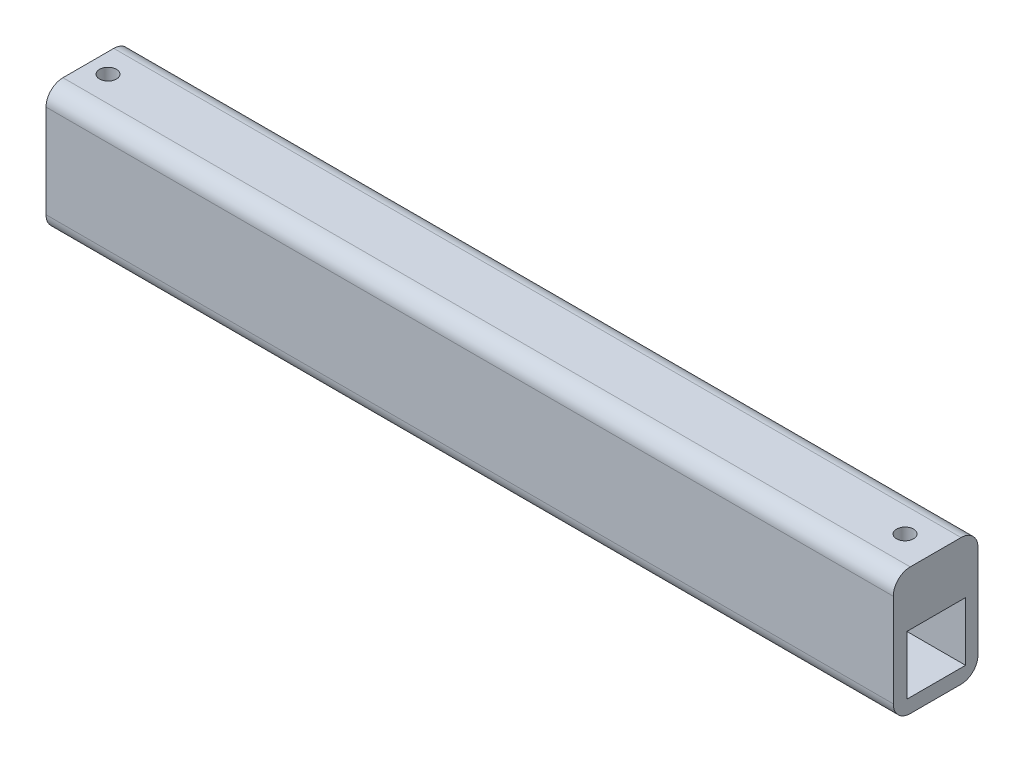
ISO-10303-21;
HEADER;
FILE_DESCRIPTION(('STEP AP214'),'2;1');
FILE_NAME('part.step','',(''),(''),'','','');
FILE_SCHEMA(('AUTOMOTIVE_DESIGN { 1 0 10303 214 1 1 1 1 }'));
ENDSEC;
DATA;
#1=APPLICATION_CONTEXT('core data for automotive mechanical design processes');
#2=APPLICATION_PROTOCOL_DEFINITION('international standard','automotive_design',2000,#1);
#3=PRODUCT_CONTEXT('',#1,'mechanical');
#4=PRODUCT('Part','Part','',(#3));
#5=PRODUCT_RELATED_PRODUCT_CATEGORY('part','',(#4));
#6=PRODUCT_DEFINITION_FORMATION('','',#4);
#7=PRODUCT_DEFINITION_CONTEXT('part definition',#1,'design');
#8=PRODUCT_DEFINITION('design','',#6,#7);
#9=PRODUCT_DEFINITION_SHAPE('','',#8);
#10=(LENGTH_UNIT() NAMED_UNIT(*) SI_UNIT(.MILLI.,.METRE.));
#11=(NAMED_UNIT(*) PLANE_ANGLE_UNIT() SI_UNIT($,.RADIAN.));
#12=(NAMED_UNIT(*) SI_UNIT($,.STERADIAN.) SOLID_ANGLE_UNIT());
#13=UNCERTAINTY_MEASURE_WITH_UNIT(LENGTH_MEASURE(1.E-05),#10,'distance_accuracy_value','');
#14=(GEOMETRIC_REPRESENTATION_CONTEXT(3) GLOBAL_UNCERTAINTY_ASSIGNED_CONTEXT((#13)) GLOBAL_UNIT_ASSIGNED_CONTEXT((#10,
#11,#12)) REPRESENTATION_CONTEXT('',''));
#15=CARTESIAN_POINT('',(0.,0.,0.));
#16=DIRECTION('',(0.,0.,1.));
#17=DIRECTION('',(1.,0.,0.));
#18=AXIS2_PLACEMENT_3D('',#15,#16,#17);
#19=CARTESIAN_POINT('',(-89.2448512585812,8.83295194508008,20.));
#20=DIRECTION('',(1.,0.,0.));
#21=DIRECTION('',(0.,1.,0.));
#22=AXIS2_PLACEMENT_3D('',#19,#20,#21);
#23=PLANE('',#22);
#24=DIRECTION('',(0.,0.,1.));
#25=VECTOR('',#24,1.);
#26=CARTESIAN_POINT('',(-89.2448512585812,-17.8165488906242,2.9396604398922));
#27=LINE('',#26,#25);
#28=CARTESIAN_POINT('',(-89.2448512585812,-17.8165488906242,2.9396604398922));
#29=VERTEX_POINT('',#28);
#30=CARTESIAN_POINT('',(-89.2448512585812,-17.8165488906242,16.8168795752765));
#31=VERTEX_POINT('',#30);
#32=EDGE_CURVE('E153',#29,#31,#27,.T.);
#33=ORIENTED_EDGE('',*,*,#32,.F.);
#34=DIRECTION('',(0.,-1.,0.));
#35=VECTOR('',#34,1.);
#36=CARTESIAN_POINT('',(-89.2448512585812,-3.96976225334377,2.9396604398922));
#37=LINE('',#36,#35);
#38=CARTESIAN_POINT('',(-89.2448512585812,-3.96976225334377,2.9396604398922));
#39=VERTEX_POINT('',#38);
#40=EDGE_CURVE('E50',#39,#29,#37,.T.);
#41=ORIENTED_EDGE('',*,*,#40,.F.);
#42=DIRECTION('',(0.,0.,-1.));
#43=VECTOR('',#42,1.);
#44=CARTESIAN_POINT('',(-89.2448512585812,-3.96976225334377,2.9396604398922));
#45=LINE('',#44,#43);
#46=CARTESIAN_POINT('',(-89.2448512585812,-3.96976225334377,16.8168795752765));
#47=VERTEX_POINT('',#46);
#48=EDGE_CURVE('E141',#47,#39,#45,.T.);
#49=ORIENTED_EDGE('',*,*,#48,.F.);
#50=DIRECTION('',(0.,1.,0.));
#51=VECTOR('',#50,1.);
#52=CARTESIAN_POINT('',(-89.2448512585812,-3.96976225334377,16.8168795752765));
#53=LINE('',#52,#51);
#54=EDGE_CURVE('E144',#31,#47,#53,.T.);
#55=ORIENTED_EDGE('',*,*,#54,.F.);
#56=EDGE_LOOP('',(#33,#41,#49,#55));
#57=FACE_BOUND('',#56,.T.);
#58=DIRECTION('',(0.,-1.,0.));
#59=VECTOR('',#58,1.);
#60=CARTESIAN_POINT('',(-89.2448512585812,8.83295194508008,0.));
#61=LINE('',#60,#59);
#62=CARTESIAN_POINT('',(-89.2448512585812,4.83295194508008,0.));
#63=VERTEX_POINT('',#62);
#64=CARTESIAN_POINT('',(-89.2448512585812,-17.1670480549199,0.));
#65=VERTEX_POINT('',#64);
#66=EDGE_CURVE('E160',#63,#65,#61,.T.);
#67=ORIENTED_EDGE('',*,*,#66,.T.);
#68=CARTESIAN_POINT('',(-89.2448512585812,-17.1670480549199,4.));
#69=DIRECTION('',(1.,0.,0.));
#70=DIRECTION('',(0.,1.,0.));
#71=AXIS2_PLACEMENT_3D('',#68,#69,#70);
#72=CIRCLE('',#71,4.);
#73=CARTESIAN_POINT('',(-89.2448512585812,-21.1670480549199,4.));
#74=VERTEX_POINT('',#73);
#75=EDGE_CURVE('E210',#65,#74,#72,.F.);
#76=ORIENTED_EDGE('',*,*,#75,.T.);
#77=DIRECTION('',(0.,0.,-1.));
#78=VECTOR('',#77,1.);
#79=CARTESIAN_POINT('',(-89.2448512585812,-21.1670480549199,20.));
#80=LINE('',#79,#78);
#81=CARTESIAN_POINT('',(-89.2448512585812,-21.1670480549199,16.));
#82=VERTEX_POINT('',#81);
#83=EDGE_CURVE('E184',#82,#74,#80,.T.);
#84=ORIENTED_EDGE('',*,*,#83,.F.);
#85=CARTESIAN_POINT('',(-89.2448512585812,-17.1670480549199,16.));
#86=DIRECTION('',(1.,0.,0.));
#87=DIRECTION('',(0.,1.,0.));
#88=AXIS2_PLACEMENT_3D('',#85,#86,#87);
#89=CIRCLE('',#88,4.);
#90=CARTESIAN_POINT('',(-89.2448512585812,-17.1670480549199,20.));
#91=VERTEX_POINT('',#90);
#92=EDGE_CURVE('E208',#82,#91,#89,.F.);
#93=ORIENTED_EDGE('',*,*,#92,.T.);
#94=DIRECTION('',(0.,-1.,0.));
#95=VECTOR('',#94,1.);
#96=CARTESIAN_POINT('',(-89.2448512585812,8.83295194508008,20.));
#97=LINE('',#96,#95);
#98=CARTESIAN_POINT('',(-89.2448512585812,4.83295194508008,20.));
#99=VERTEX_POINT('',#98);
#100=EDGE_CURVE('E164',#99,#91,#97,.T.);
#101=ORIENTED_EDGE('',*,*,#100,.F.);
#102=CARTESIAN_POINT('',(-89.2448512585812,4.83295194508008,16.));
#103=DIRECTION('',(1.,0.,0.));
#104=DIRECTION('',(0.,1.,0.));
#105=AXIS2_PLACEMENT_3D('',#102,#103,#104);
#106=CIRCLE('',#105,4.);
#107=CARTESIAN_POINT('',(-89.2448512585812,8.83295194508008,16.));
#108=VERTEX_POINT('',#107);
#109=EDGE_CURVE('E206',#99,#108,#106,.F.);
#110=ORIENTED_EDGE('',*,*,#109,.T.);
#111=DIRECTION('',(0.,0.,-1.));
#112=VECTOR('',#111,1.);
#113=CARTESIAN_POINT('',(-89.2448512585812,8.83295194508008,20.));
#114=LINE('',#113,#112);
#115=CARTESIAN_POINT('',(-89.2448512585812,8.83295194508008,4.));
#116=VERTEX_POINT('',#115);
#117=EDGE_CURVE('E171',#108,#116,#114,.T.);
#118=ORIENTED_EDGE('',*,*,#117,.T.);
#119=CARTESIAN_POINT('',(-89.2448512585812,4.83295194508008,4.));
#120=DIRECTION('',(1.,0.,0.));
#121=DIRECTION('',(0.,1.,0.));
#122=AXIS2_PLACEMENT_3D('',#119,#120,#121);
#123=CIRCLE('',#122,4.);
#124=EDGE_CURVE('E204',#116,#63,#123,.F.);
#125=ORIENTED_EDGE('',*,*,#124,.T.);
#126=EDGE_LOOP('',(#67,#76,#84,#93,#101,#110,#118,#125));
#127=FACE_BOUND('',#126,.T.);
#128=ADVANCED_FACE('F33',(#57,#127),#23,.F.);
#129=CARTESIAN_POINT('',(-89.2448512585812,-21.1670480549199,20.));
#130=DIRECTION('',(0.,1.,0.));
#131=DIRECTION('',(0.,0.,1.));
#132=AXIS2_PLACEMENT_3D('',#129,#130,#131);
#133=PLANE('',#132);
#134=ORIENTED_EDGE('',*,*,#83,.T.);
#135=DIRECTION('',(1.,0.,0.));
#136=VECTOR('',#135,1.);
#137=CARTESIAN_POINT('',(-89.2448512585812,-21.1670480549199,4.));
#138=LINE('',#137,#136);
#139=CARTESIAN_POINT('',(110.755148741419,-21.1670480549199,4.));
#140=VERTEX_POINT('',#139);
#141=EDGE_CURVE('E189',#74,#140,#138,.T.);
#142=ORIENTED_EDGE('',*,*,#141,.T.);
#143=DIRECTION('',(0.,0.,-1.));
#144=VECTOR('',#143,1.);
#145=CARTESIAN_POINT('',(110.755148741419,-21.1670480549199,20.));
#146=LINE('',#145,#144);
#147=CARTESIAN_POINT('',(110.755148741419,-21.1670480549199,16.));
#148=VERTEX_POINT('',#147);
#149=EDGE_CURVE('E181',#148,#140,#146,.T.);
#150=ORIENTED_EDGE('',*,*,#149,.F.);
#151=DIRECTION('',(1.,0.,0.));
#152=VECTOR('',#151,1.);
#153=CARTESIAN_POINT('',(-89.2448512585812,-21.1670480549199,16.));
#154=LINE('',#153,#152);
#155=EDGE_CURVE('E187',#148,#82,#154,.F.);
#156=ORIENTED_EDGE('',*,*,#155,.T.);
#157=EDGE_LOOP('',(#134,#142,#150,#156));
#158=FACE_BOUND('',#157,.T.);
#159=ADVANCED_FACE('F260',(#158),#133,.F.);
#160=CARTESIAN_POINT('',(110.755148741419,8.83295194508008,20.));
#161=DIRECTION('',(-1.,0.,0.));
#162=DIRECTION('',(0.,-1.,0.));
#163=AXIS2_PLACEMENT_3D('',#160,#161,#162);
#164=PLANE('',#163);
#165=DIRECTION('',(0.,0.,-1.));
#166=VECTOR('',#165,1.);
#167=CARTESIAN_POINT('',(110.755148741419,-3.96976225334391,2.9396604398922));
#168=LINE('',#167,#166);
#169=CARTESIAN_POINT('',(110.755148741419,-3.96976225334391,16.8168795752765));
#170=VERTEX_POINT('',#169);
#171=CARTESIAN_POINT('',(110.755148741419,-3.96976225334391,2.9396604398922));
#172=VERTEX_POINT('',#171);
#173=EDGE_CURVE('E131',#170,#172,#168,.T.);
#174=ORIENTED_EDGE('',*,*,#173,.T.);
#175=DIRECTION('',(0.,-1.,0.));
#176=VECTOR('',#175,1.);
#177=CARTESIAN_POINT('',(110.755148741419,-3.96976225334391,2.9396604398922));
#178=LINE('',#177,#176);
#179=CARTESIAN_POINT('',(110.755148741419,-17.8165488906243,2.9396604398922));
#180=VERTEX_POINT('',#179);
#181=EDGE_CURVE('E125',#172,#180,#178,.T.);
#182=ORIENTED_EDGE('',*,*,#181,.T.);
#183=DIRECTION('',(0.,0.,1.));
#184=VECTOR('',#183,1.);
#185=CARTESIAN_POINT('',(110.755148741419,-17.8165488906243,2.9396604398922));
#186=LINE('',#185,#184);
#187=CARTESIAN_POINT('',(110.755148741419,-17.8165488906243,16.8168795752765));
#188=VERTEX_POINT('',#187);
#189=EDGE_CURVE('E134',#180,#188,#186,.T.);
#190=ORIENTED_EDGE('',*,*,#189,.T.);
#191=DIRECTION('',(0.,1.,0.));
#192=VECTOR('',#191,1.);
#193=CARTESIAN_POINT('',(110.755148741419,-3.96976225334391,16.8168795752765));
#194=LINE('',#193,#192);
#195=EDGE_CURVE('E58',#188,#170,#194,.T.);
#196=ORIENTED_EDGE('',*,*,#195,.T.);
#197=EDGE_LOOP('',(#174,#182,#190,#196));
#198=FACE_BOUND('',#197,.T.);
#199=ORIENTED_EDGE('',*,*,#149,.T.);
#200=CARTESIAN_POINT('',(110.755148741419,-17.1670480549199,4.));
#201=DIRECTION('',(-1.,0.,0.));
#202=DIRECTION('',(0.,-1.,0.));
#203=AXIS2_PLACEMENT_3D('',#200,#201,#202);
#204=CIRCLE('',#203,4.);
#205=CARTESIAN_POINT('',(110.755148741419,-17.1670480549199,0.));
#206=VERTEX_POINT('',#205);
#207=EDGE_CURVE('E198',#140,#206,#204,.F.);
#208=ORIENTED_EDGE('',*,*,#207,.T.);
#209=DIRECTION('',(0.,1.,0.));
#210=VECTOR('',#209,1.);
#211=CARTESIAN_POINT('',(110.755148741419,8.83295194508008,0.));
#212=LINE('',#211,#210);
#213=CARTESIAN_POINT('',(110.755148741419,4.83295194508008,0.));
#214=VERTEX_POINT('',#213);
#215=EDGE_CURVE('E168',#206,#214,#212,.T.);
#216=ORIENTED_EDGE('',*,*,#215,.T.);
#217=CARTESIAN_POINT('',(110.755148741419,4.83295194508008,4.));
#218=DIRECTION('',(-1.,0.,0.));
#219=DIRECTION('',(0.,-1.,0.));
#220=AXIS2_PLACEMENT_3D('',#217,#218,#219);
#221=CIRCLE('',#220,4.);
#222=CARTESIAN_POINT('',(110.755148741419,8.83295194508008,4.));
#223=VERTEX_POINT('',#222);
#224=EDGE_CURVE('E192',#214,#223,#221,.F.);
#225=ORIENTED_EDGE('',*,*,#224,.T.);
#226=DIRECTION('',(0.,0.,-1.));
#227=VECTOR('',#226,1.);
#228=CARTESIAN_POINT('',(110.755148741419,8.83295194508008,20.));
#229=LINE('',#228,#227);
#230=CARTESIAN_POINT('',(110.755148741419,8.83295194508008,16.));
#231=VERTEX_POINT('',#230);
#232=EDGE_CURVE('E178',#231,#223,#229,.T.);
#233=ORIENTED_EDGE('',*,*,#232,.F.);
#234=CARTESIAN_POINT('',(110.755148741419,4.83295194508008,16.));
#235=DIRECTION('',(-1.,0.,0.));
#236=DIRECTION('',(0.,-1.,0.));
#237=AXIS2_PLACEMENT_3D('',#234,#235,#236);
#238=CIRCLE('',#237,4.);
#239=CARTESIAN_POINT('',(110.755148741419,4.83295194508008,20.));
#240=VERTEX_POINT('',#239);
#241=EDGE_CURVE('E194',#231,#240,#238,.F.);
#242=ORIENTED_EDGE('',*,*,#241,.T.);
#243=DIRECTION('',(0.,1.,0.));
#244=VECTOR('',#243,1.);
#245=CARTESIAN_POINT('',(110.755148741419,8.83295194508008,20.));
#246=LINE('',#245,#244);
#247=CARTESIAN_POINT('',(110.755148741419,-17.1670480549199,20.));
#248=VERTEX_POINT('',#247);
#249=EDGE_CURVE('E167',#248,#240,#246,.T.);
#250=ORIENTED_EDGE('',*,*,#249,.F.);
#251=CARTESIAN_POINT('',(110.755148741419,-17.1670480549199,16.));
#252=DIRECTION('',(-1.,0.,0.));
#253=DIRECTION('',(0.,-1.,0.));
#254=AXIS2_PLACEMENT_3D('',#251,#252,#253);
#255=CIRCLE('',#254,4.);
#256=EDGE_CURVE('E196',#248,#148,#255,.F.);
#257=ORIENTED_EDGE('',*,*,#256,.T.);
#258=EDGE_LOOP('',(#199,#208,#216,#225,#233,#242,#250,#257));
#259=FACE_BOUND('',#258,.T.);
#260=ADVANCED_FACE('F138',(#198,#259),#164,.F.);
#261=CARTESIAN_POINT('',(-89.2448512585812,8.83295194508008,20.));
#262=DIRECTION('',(0.,-1.,0.));
#263=DIRECTION('',(0.,0.,-1.));
#264=AXIS2_PLACEMENT_3D('',#261,#262,#263);
#265=PLANE('',#264);
#266=CARTESIAN_POINT('',(103.408272514149,8.83295194508008,9.88241989368935));
#267=DIRECTION('',(0.,1.,0.));
#268=DIRECTION('',(0.,0.,1.));
#269=AXIS2_PLACEMENT_3D('',#266,#267,#268);
#270=CIRCLE('',#269,2.);
#271=CARTESIAN_POINT('',(103.408272514149,8.83295194508008,11.8824198936893));
#272=VERTEX_POINT('',#271);
#273=EDGE_CURVE('E226',#272,#272,#270,.T.);
#274=ORIENTED_EDGE('',*,*,#273,.F.);
#275=EDGE_LOOP('',(#274));
#276=FACE_BOUND('',#275,.T.);
#277=CARTESIAN_POINT('',(-84.6471146839258,8.83295194508008,9.96043270365273));
#278=DIRECTION('',(0.,1.,0.));
#279=DIRECTION('',(0.,0.,1.));
#280=AXIS2_PLACEMENT_3D('',#277,#278,#279);
#281=CIRCLE('',#280,2.);
#282=CARTESIAN_POINT('',(-84.6471146839258,8.83295194508008,11.9604327036527));
#283=VERTEX_POINT('',#282);
#284=EDGE_CURVE('E147',#283,#283,#281,.T.);
#285=ORIENTED_EDGE('',*,*,#284,.F.);
#286=EDGE_LOOP('',(#285));
#287=FACE_BOUND('',#286,.T.);
#288=ORIENTED_EDGE('',*,*,#117,.F.);
#289=DIRECTION('',(-1.,0.,0.));
#290=VECTOR('',#289,1.);
#291=CARTESIAN_POINT('',(110.755148741419,8.83295194508008,16.));
#292=LINE('',#291,#290);
#293=EDGE_CURVE('E11',#108,#231,#292,.F.);
#294=ORIENTED_EDGE('',*,*,#293,.T.);
#295=ORIENTED_EDGE('',*,*,#232,.T.);
#296=DIRECTION('',(-1.,0.,0.));
#297=VECTOR('',#296,1.);
#298=CARTESIAN_POINT('',(-89.2448512585812,8.83295194508008,4.));
#299=LINE('',#298,#297);
#300=EDGE_CURVE('E42',#223,#116,#299,.T.);
#301=ORIENTED_EDGE('',*,*,#300,.T.);
#302=EDGE_LOOP('',(#288,#294,#295,#301));
#303=FACE_BOUND('',#302,.T.);
#304=ADVANCED_FACE('F235',(#276,#287,#303),#265,.F.);
#305=CARTESIAN_POINT('',(0.,0.,20.));
#306=DIRECTION('',(0.,0.,1.));
#307=DIRECTION('',(1.,0.,0.));
#308=AXIS2_PLACEMENT_3D('',#305,#306,#307);
#309=PLANE('',#308);
#310=ORIENTED_EDGE('',*,*,#100,.T.);
#311=DIRECTION('',(1.,0.,0.));
#312=VECTOR('',#311,1.);
#313=CARTESIAN_POINT('',(110.755148741419,-17.1670480549199,20.));
#314=LINE('',#313,#312);
#315=EDGE_CURVE('E215',#91,#248,#314,.T.);
#316=ORIENTED_EDGE('',*,*,#315,.T.);
#317=ORIENTED_EDGE('',*,*,#249,.T.);
#318=DIRECTION('',(-1.,0.,0.));
#319=VECTOR('',#318,1.);
#320=CARTESIAN_POINT('',(-89.2448512585812,4.83295194508008,20.));
#321=LINE('',#320,#319);
#322=EDGE_CURVE('E212',#240,#99,#321,.T.);
#323=ORIENTED_EDGE('',*,*,#322,.T.);
#324=EDGE_LOOP('',(#310,#316,#317,#323));
#325=FACE_BOUND('',#324,.T.);
#326=ADVANCED_FACE('F238',(#325),#309,.T.);
#327=CARTESIAN_POINT('',(0.,0.,0.));
#328=DIRECTION('',(0.,0.,1.));
#329=DIRECTION('',(1.,0.,0.));
#330=AXIS2_PLACEMENT_3D('',#327,#328,#329);
#331=PLANE('',#330);
#332=ORIENTED_EDGE('',*,*,#215,.F.);
#333=DIRECTION('',(1.,0.,0.));
#334=VECTOR('',#333,1.);
#335=CARTESIAN_POINT('',(0.,-17.1670480549199,0.));
#336=LINE('',#335,#334);
#337=EDGE_CURVE('E202',#206,#65,#336,.F.);
#338=ORIENTED_EDGE('',*,*,#337,.T.);
#339=ORIENTED_EDGE('',*,*,#66,.F.);
#340=DIRECTION('',(-1.,0.,0.));
#341=VECTOR('',#340,1.);
#342=CARTESIAN_POINT('',(0.,4.83295194508008,0.));
#343=LINE('',#342,#341);
#344=EDGE_CURVE('E200',#63,#214,#343,.F.);
#345=ORIENTED_EDGE('',*,*,#344,.T.);
#346=EDGE_LOOP('',(#332,#338,#339,#345));
#347=FACE_BOUND('',#346,.T.);
#348=ADVANCED_FACE('F270',(#347),#331,.F.);
#349=CARTESIAN_POINT('',(-89.2448512585812,-17.1670480549199,4.));
#350=DIRECTION('',(1.,0.,0.));
#351=DIRECTION('',(0.,0.,-1.));
#352=AXIS2_PLACEMENT_3D('',#349,#350,#351);
#353=CYLINDRICAL_SURFACE('',#352,4.);
#354=ORIENTED_EDGE('',*,*,#75,.F.);
#355=ORIENTED_EDGE('',*,*,#337,.F.);
#356=ORIENTED_EDGE('',*,*,#207,.F.);
#357=ORIENTED_EDGE('',*,*,#141,.F.);
#358=EDGE_LOOP('',(#354,#355,#356,#357));
#359=FACE_BOUND('',#358,.T.);
#360=ADVANCED_FACE('F265',(#359),#353,.T.);
#361=CARTESIAN_POINT('',(0.,-17.1670480549199,16.));
#362=DIRECTION('',(-1.,0.,0.));
#363=DIRECTION('',(0.,0.,1.));
#364=AXIS2_PLACEMENT_3D('',#361,#362,#363);
#365=CYLINDRICAL_SURFACE('',#364,4.);
#366=ORIENTED_EDGE('',*,*,#92,.F.);
#367=ORIENTED_EDGE('',*,*,#155,.F.);
#368=ORIENTED_EDGE('',*,*,#256,.F.);
#369=ORIENTED_EDGE('',*,*,#315,.F.);
#370=EDGE_LOOP('',(#366,#367,#368,#369));
#371=FACE_BOUND('',#370,.T.);
#372=ADVANCED_FACE('F256',(#371),#365,.T.);
#373=CARTESIAN_POINT('',(0.,4.83295194508008,16.));
#374=DIRECTION('',(1.,0.,0.));
#375=DIRECTION('',(0.,0.,-1.));
#376=AXIS2_PLACEMENT_3D('',#373,#374,#375);
#377=CYLINDRICAL_SURFACE('',#376,4.);
#378=ORIENTED_EDGE('',*,*,#241,.F.);
#379=ORIENTED_EDGE('',*,*,#293,.F.);
#380=ORIENTED_EDGE('',*,*,#109,.F.);
#381=ORIENTED_EDGE('',*,*,#322,.F.);
#382=EDGE_LOOP('',(#378,#379,#380,#381));
#383=FACE_BOUND('',#382,.T.);
#384=ADVANCED_FACE('F248',(#383),#377,.T.);
#385=CARTESIAN_POINT('',(-89.2448512585812,4.83295194508008,4.));
#386=DIRECTION('',(-1.,0.,0.));
#387=DIRECTION('',(0.,0.,1.));
#388=AXIS2_PLACEMENT_3D('',#385,#386,#387);
#389=CYLINDRICAL_SURFACE('',#388,4.);
#390=ORIENTED_EDGE('',*,*,#224,.F.);
#391=ORIENTED_EDGE('',*,*,#344,.F.);
#392=ORIENTED_EDGE('',*,*,#124,.F.);
#393=ORIENTED_EDGE('',*,*,#300,.F.);
#394=EDGE_LOOP('',(#390,#391,#392,#393));
#395=FACE_BOUND('',#394,.T.);
#396=ADVANCED_FACE('F35',(#395),#389,.T.);
#397=CARTESIAN_POINT('',(110.755148741419,-3.96976225334391,2.9396604398922));
#398=DIRECTION('',(0.,0.,-1.));
#399=DIRECTION('',(-1.,0.,0.));
#400=AXIS2_PLACEMENT_3D('',#397,#398,#399);
#401=PLANE('',#400);
#402=ORIENTED_EDGE('',*,*,#40,.T.);
#403=DIRECTION('',(-1.,0.,0.));
#404=VECTOR('',#403,1.);
#405=CARTESIAN_POINT('',(110.755148741419,-17.8165488906243,2.9396604398922));
#406=LINE('',#405,#404);
#407=EDGE_CURVE('E121',#180,#29,#406,.T.);
#408=ORIENTED_EDGE('',*,*,#407,.F.);
#409=ORIENTED_EDGE('',*,*,#181,.F.);
#410=DIRECTION('',(-1.,0.,0.));
#411=VECTOR('',#410,1.);
#412=CARTESIAN_POINT('',(110.755148741419,-3.96976225334391,2.9396604398922));
#413=LINE('',#412,#411);
#414=EDGE_CURVE('E158',#172,#39,#413,.T.);
#415=ORIENTED_EDGE('',*,*,#414,.T.);
#416=EDGE_LOOP('',(#402,#408,#409,#415));
#417=FACE_BOUND('',#416,.T.);
#418=ADVANCED_FACE('F123',(#417),#401,.F.);
#419=CARTESIAN_POINT('',(110.755148741419,-3.96976225334391,2.9396604398922));
#420=DIRECTION('',(0.,1.,0.));
#421=DIRECTION('',(-1.,0.,0.));
#422=AXIS2_PLACEMENT_3D('',#419,#420,#421);
#423=PLANE('',#422);
#424=CARTESIAN_POINT('',(103.408272514149,-3.9697622533439,9.88241989368935));
#425=DIRECTION('',(0.,1.,0.));
#426=DIRECTION('',(-1.,0.,0.));
#427=AXIS2_PLACEMENT_3D('',#424,#425,#426);
#428=CIRCLE('',#427,2.);
#429=CARTESIAN_POINT('',(101.408272514149,-3.9697622533439,9.88241989368935));
#430=VERTEX_POINT('',#429);
#431=EDGE_CURVE('E37',#430,#430,#428,.T.);
#432=ORIENTED_EDGE('',*,*,#431,.T.);
#433=EDGE_LOOP('',(#432));
#434=FACE_BOUND('',#433,.T.);
#435=CARTESIAN_POINT('',(-84.6471146839258,-3.96976225334377,9.96043270365273));
#436=DIRECTION('',(0.,1.,0.));
#437=DIRECTION('',(-1.,0.,0.));
#438=AXIS2_PLACEMENT_3D('',#435,#436,#437);
#439=CIRCLE('',#438,2.);
#440=CARTESIAN_POINT('',(-86.6471146839259,-3.96976225334377,9.96043270365273));
#441=VERTEX_POINT('',#440);
#442=EDGE_CURVE('E154',#441,#441,#439,.T.);
#443=ORIENTED_EDGE('',*,*,#442,.T.);
#444=EDGE_LOOP('',(#443));
#445=FACE_BOUND('',#444,.T.);
#446=ORIENTED_EDGE('',*,*,#48,.T.);
#447=ORIENTED_EDGE('',*,*,#414,.F.);
#448=ORIENTED_EDGE('',*,*,#173,.F.);
#449=DIRECTION('',(-1.,0.,0.));
#450=VECTOR('',#449,1.);
#451=CARTESIAN_POINT('',(110.755148741419,-3.96976225334391,16.8168795752765));
#452=LINE('',#451,#450);
#453=EDGE_CURVE('E161',#170,#47,#452,.T.);
#454=ORIENTED_EDGE('',*,*,#453,.T.);
#455=EDGE_LOOP('',(#446,#447,#448,#454));
#456=FACE_BOUND('',#455,.T.);
#457=ADVANCED_FACE('F293',(#434,#445,#456),#423,.F.);
#458=CARTESIAN_POINT('',(110.755148741419,-3.96976225334391,16.8168795752765));
#459=DIRECTION('',(0.,0.,1.));
#460=DIRECTION('',(1.,0.,0.));
#461=AXIS2_PLACEMENT_3D('',#458,#459,#460);
#462=PLANE('',#461);
#463=ORIENTED_EDGE('',*,*,#54,.T.);
#464=ORIENTED_EDGE('',*,*,#453,.F.);
#465=ORIENTED_EDGE('',*,*,#195,.F.);
#466=DIRECTION('',(-1.,0.,0.));
#467=VECTOR('',#466,1.);
#468=CARTESIAN_POINT('',(110.755148741419,-17.8165488906243,16.8168795752765));
#469=LINE('',#468,#467);
#470=EDGE_CURVE('E130',#188,#31,#469,.T.);
#471=ORIENTED_EDGE('',*,*,#470,.T.);
#472=EDGE_LOOP('',(#463,#464,#465,#471));
#473=FACE_BOUND('',#472,.T.);
#474=ADVANCED_FACE('F298',(#473),#462,.F.);
#475=CARTESIAN_POINT('',(110.755148741419,-17.8165488906243,2.9396604398922));
#476=DIRECTION('',(0.,-1.,0.));
#477=DIRECTION('',(1.,0.,0.));
#478=AXIS2_PLACEMENT_3D('',#475,#476,#477);
#479=PLANE('',#478);
#480=ORIENTED_EDGE('',*,*,#32,.T.);
#481=ORIENTED_EDGE('',*,*,#470,.F.);
#482=ORIENTED_EDGE('',*,*,#189,.F.);
#483=ORIENTED_EDGE('',*,*,#407,.T.);
#484=EDGE_LOOP('',(#480,#481,#482,#483));
#485=FACE_BOUND('',#484,.T.);
#486=ADVANCED_FACE('F135',(#485),#479,.F.);
#487=CARTESIAN_POINT('',(-84.6471146839258,-11.1670480549199,9.96043270365273));
#488=DIRECTION('',(0.,1.,0.));
#489=DIRECTION('',(0.,0.,1.));
#490=AXIS2_PLACEMENT_3D('',#487,#488,#489);
#491=CYLINDRICAL_SURFACE('',#490,2.);
#492=ORIENTED_EDGE('',*,*,#284,.T.);
#493=EDGE_LOOP('',(#492));
#494=FACE_BOUND('',#493,.T.);
#495=ORIENTED_EDGE('',*,*,#442,.F.);
#496=EDGE_LOOP('',(#495));
#497=FACE_BOUND('',#496,.T.);
#498=ADVANCED_FACE('F384',(#494,#497),#491,.F.);
#499=CARTESIAN_POINT('',(103.408272514149,-11.1670480549199,9.88241989368935));
#500=DIRECTION('',(0.,1.,0.));
#501=DIRECTION('',(0.,0.,1.));
#502=AXIS2_PLACEMENT_3D('',#499,#500,#501);
#503=CYLINDRICAL_SURFACE('',#502,2.);
#504=ORIENTED_EDGE('',*,*,#273,.T.);
#505=EDGE_LOOP('',(#504));
#506=FACE_BOUND('',#505,.T.);
#507=ORIENTED_EDGE('',*,*,#431,.F.);
#508=EDGE_LOOP('',(#507));
#509=FACE_BOUND('',#508,.T.);
#510=ADVANCED_FACE('F232',(#506,#509),#503,.F.);
#511=CLOSED_SHELL('',(#128,#159,#260,#304,#326,#348,#360,#372,#384,#396,#418,#457,#474,#486,
#498,#510));
#512=MANIFOLD_SOLID_BREP('B2',#511);
#513=ADVANCED_BREP_SHAPE_REPRESENTATION('',(#18,#512),#14);
#514=SHAPE_DEFINITION_REPRESENTATION(#9,#513);
ENDSEC;
END-ISO-10303-21;
